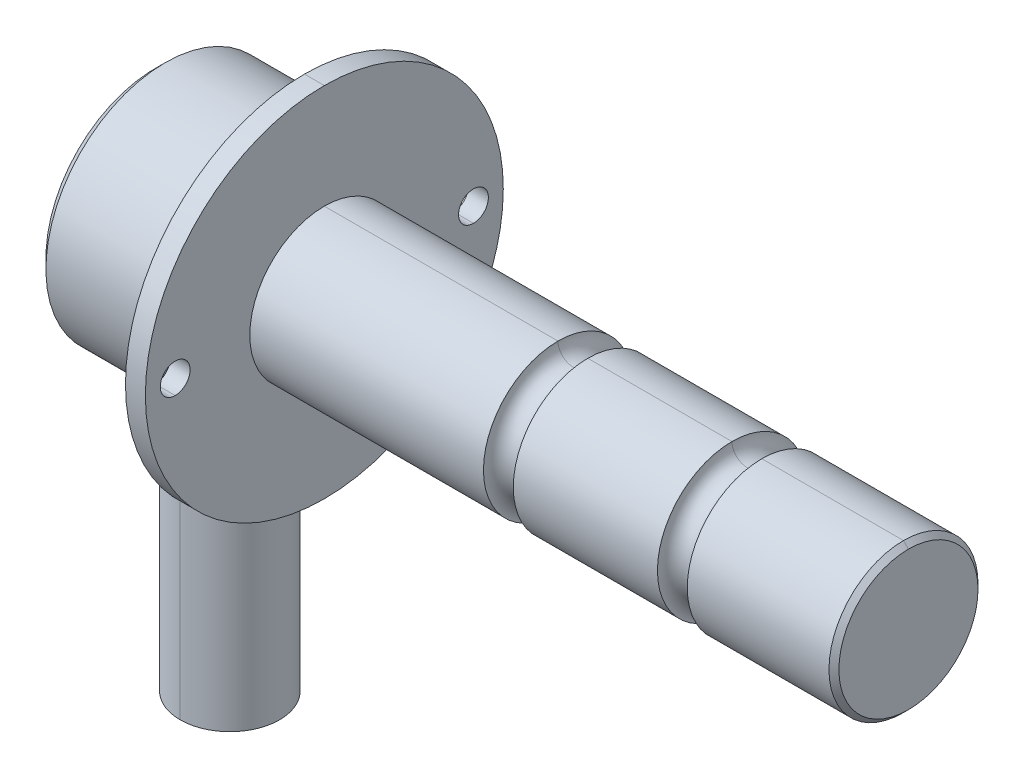
ISO-10303-21;
HEADER;
FILE_DESCRIPTION(('STEP AP214'),'2;1');
FILE_NAME('part.step','',(''),(''),'','','');
FILE_SCHEMA(('AUTOMOTIVE_DESIGN { 1 0 10303 214 1 1 1 1 }'));
ENDSEC;
DATA;
#1=APPLICATION_CONTEXT('core data for automotive mechanical design processes');
#2=APPLICATION_PROTOCOL_DEFINITION('international standard','automotive_design',2000,#1);
#3=PRODUCT_CONTEXT('',#1,'mechanical');
#4=PRODUCT('Part','Part','',(#3));
#5=PRODUCT_RELATED_PRODUCT_CATEGORY('part','',(#4));
#6=PRODUCT_DEFINITION_FORMATION('','',#4);
#7=PRODUCT_DEFINITION_CONTEXT('part definition',#1,'design');
#8=PRODUCT_DEFINITION('design','',#6,#7);
#9=PRODUCT_DEFINITION_SHAPE('','',#8);
#10=(LENGTH_UNIT() NAMED_UNIT(*) SI_UNIT(.MILLI.,.METRE.));
#11=(NAMED_UNIT(*) PLANE_ANGLE_UNIT() SI_UNIT($,.RADIAN.));
#12=(NAMED_UNIT(*) SI_UNIT($,.STERADIAN.) SOLID_ANGLE_UNIT());
#13=UNCERTAINTY_MEASURE_WITH_UNIT(LENGTH_MEASURE(1.E-05),#10,'distance_accuracy_value','');
#14=(GEOMETRIC_REPRESENTATION_CONTEXT(3) GLOBAL_UNCERTAINTY_ASSIGNED_CONTEXT((#13)) GLOBAL_UNIT_ASSIGNED_CONTEXT((#10,
#11,#12)) REPRESENTATION_CONTEXT('',''));
#15=CARTESIAN_POINT('',(0.,0.,0.));
#16=DIRECTION('',(0.,0.,1.));
#17=DIRECTION('',(1.,0.,0.));
#18=AXIS2_PLACEMENT_3D('',#15,#16,#17);
#19=CARTESIAN_POINT('',(0.,0.,0.));
#20=DIRECTION('',(1.,0.,0.));
#21=DIRECTION('',(0.,-1.,0.));
#22=AXIS2_PLACEMENT_3D('',#19,#20,#21);
#23=PLANE('',#22);
#24=CARTESIAN_POINT('',(0.,0.,30.));
#25=DIRECTION('',(1.,0.,0.));
#26=DIRECTION('',(0.,-1.,0.));
#27=AXIS2_PLACEMENT_3D('',#24,#25,#26);
#28=CIRCLE('',#27,3.);
#29=CARTESIAN_POINT('',(0.,-3.,30.));
#30=VERTEX_POINT('',#29);
#31=CARTESIAN_POINT('',(0.,3.,30.));
#32=VERTEX_POINT('',#31);
#33=EDGE_CURVE('E140',#30,#32,#28,.T.);
#34=ORIENTED_EDGE('',*,*,#33,.F.);
#35=CARTESIAN_POINT('',(0.,0.,30.));
#36=DIRECTION('',(1.,0.,0.));
#37=DIRECTION('',(0.,1.,0.));
#38=AXIS2_PLACEMENT_3D('',#35,#36,#37);
#39=CIRCLE('',#38,3.);
#40=EDGE_CURVE('E36',#32,#30,#39,.T.);
#41=ORIENTED_EDGE('',*,*,#40,.F.);
#42=EDGE_LOOP('',(#34,#41));
#43=FACE_BOUND('',#42,.T.);
#44=CARTESIAN_POINT('',(0.,0.,-30.));
#45=DIRECTION('',(1.,0.,0.));
#46=DIRECTION('',(0.,-1.,0.));
#47=AXIS2_PLACEMENT_3D('',#44,#45,#46);
#48=CIRCLE('',#47,3.);
#49=CARTESIAN_POINT('',(0.,-3.,-30.));
#50=VERTEX_POINT('',#49);
#51=CARTESIAN_POINT('',(0.,3.,-30.));
#52=VERTEX_POINT('',#51);
#53=EDGE_CURVE('E206',#50,#52,#48,.T.);
#54=ORIENTED_EDGE('',*,*,#53,.F.);
#55=CARTESIAN_POINT('',(0.,0.,-30.));
#56=DIRECTION('',(1.,0.,0.));
#57=DIRECTION('',(0.,1.,0.));
#58=AXIS2_PLACEMENT_3D('',#55,#56,#57);
#59=CIRCLE('',#58,3.);
#60=EDGE_CURVE('E155',#52,#50,#59,.T.);
#61=ORIENTED_EDGE('',*,*,#60,.F.);
#62=EDGE_LOOP('',(#54,#61));
#63=FACE_BOUND('',#62,.T.);
#64=CARTESIAN_POINT('',(0.,0.,0.));
#65=DIRECTION('',(1.,0.,0.));
#66=DIRECTION('',(0.,1.,0.));
#67=AXIS2_PLACEMENT_3D('',#64,#65,#66);
#68=CIRCLE('',#67,14.99);
#69=CARTESIAN_POINT('',(0.,14.99,0.));
#70=VERTEX_POINT('',#69);
#71=CARTESIAN_POINT('',(0.,-14.99,0.));
#72=VERTEX_POINT('',#71);
#73=EDGE_CURVE('E159',#70,#72,#68,.T.);
#74=ORIENTED_EDGE('',*,*,#73,.F.);
#75=CARTESIAN_POINT('',(0.,0.,0.));
#76=DIRECTION('',(-1.,0.,0.));
#77=DIRECTION('',(0.,1.,0.));
#78=AXIS2_PLACEMENT_3D('',#75,#76,#77);
#79=CIRCLE('',#78,14.99);
#80=EDGE_CURVE('E11',#70,#72,#79,.T.);
#81=ORIENTED_EDGE('',*,*,#80,.T.);
#82=EDGE_LOOP('',(#74,#81));
#83=FACE_BOUND('',#82,.T.);
#84=CARTESIAN_POINT('',(0.,0.,0.));
#85=DIRECTION('',(-1.,0.,0.));
#86=DIRECTION('',(0.,1.,0.));
#87=AXIS2_PLACEMENT_3D('',#84,#85,#86);
#88=CIRCLE('',#87,36.);
#89=CARTESIAN_POINT('',(0.,36.,0.));
#90=VERTEX_POINT('',#89);
#91=CARTESIAN_POINT('',(0.,-36.,0.));
#92=VERTEX_POINT('',#91);
#93=EDGE_CURVE('E193',#90,#92,#88,.T.);
#94=ORIENTED_EDGE('',*,*,#93,.F.);
#95=CARTESIAN_POINT('',(0.,0.,0.));
#96=DIRECTION('',(1.,0.,0.));
#97=DIRECTION('',(0.,1.,0.));
#98=AXIS2_PLACEMENT_3D('',#95,#96,#97);
#99=CIRCLE('',#98,36.);
#100=EDGE_CURVE('E27',#90,#92,#99,.T.);
#101=ORIENTED_EDGE('',*,*,#100,.T.);
#102=EDGE_LOOP('',(#94,#101));
#103=FACE_BOUND('',#102,.T.);
#104=ADVANCED_FACE('F16',(#43,#63,#83,#103),#23,.T.);
#105=CARTESIAN_POINT('',(-4.,0.,30.));
#106=DIRECTION('',(-1.,0.,0.));
#107=DIRECTION('',(0.,1.,0.));
#108=AXIS2_PLACEMENT_3D('',#105,#106,#107);
#109=CYLINDRICAL_SURFACE('',#108,3.);
#110=DIRECTION('',(1.,0.,0.));
#111=VECTOR('',#110,1.);
#112=CARTESIAN_POINT('',(-4.,3.,30.));
#113=LINE('',#112,#111);
#114=CARTESIAN_POINT('',(-4.,3.,30.));
#115=VERTEX_POINT('',#114);
#116=EDGE_CURVE('E130',#115,#32,#113,.T.);
#117=ORIENTED_EDGE('',*,*,#116,.F.);
#118=CARTESIAN_POINT('',(-4.,0.,30.));
#119=DIRECTION('',(1.,0.,0.));
#120=DIRECTION('',(0.,-1.,0.));
#121=AXIS2_PLACEMENT_3D('',#118,#119,#120);
#122=CIRCLE('',#121,3.);
#123=CARTESIAN_POINT('',(-4.,-3.,30.));
#124=VERTEX_POINT('',#123);
#125=EDGE_CURVE('E126',#124,#115,#122,.T.);
#126=ORIENTED_EDGE('',*,*,#125,.F.);
#127=DIRECTION('',(1.,0.,0.));
#128=VECTOR('',#127,1.);
#129=CARTESIAN_POINT('',(-4.,-3.,30.));
#130=LINE('',#129,#128);
#131=EDGE_CURVE('E129',#124,#30,#130,.T.);
#132=ORIENTED_EDGE('',*,*,#131,.T.);
#133=ORIENTED_EDGE('',*,*,#33,.T.);
#134=EDGE_LOOP('',(#117,#126,#132,#133));
#135=FACE_BOUND('',#134,.T.);
#136=ADVANCED_FACE('F127',(#135),#109,.F.);
#137=CARTESIAN_POINT('',(-4.,0.,30.));
#138=DIRECTION('',(-1.,0.,0.));
#139=DIRECTION('',(0.,1.,0.));
#140=AXIS2_PLACEMENT_3D('',#137,#138,#139);
#141=CYLINDRICAL_SURFACE('',#140,3.);
#142=ORIENTED_EDGE('',*,*,#131,.F.);
#143=CARTESIAN_POINT('',(-4.,0.,30.));
#144=DIRECTION('',(1.,0.,0.));
#145=DIRECTION('',(0.,1.,0.));
#146=AXIS2_PLACEMENT_3D('',#143,#144,#145);
#147=CIRCLE('',#146,3.);
#148=EDGE_CURVE('E136',#115,#124,#147,.T.);
#149=ORIENTED_EDGE('',*,*,#148,.F.);
#150=ORIENTED_EDGE('',*,*,#116,.T.);
#151=ORIENTED_EDGE('',*,*,#40,.T.);
#152=EDGE_LOOP('',(#142,#149,#150,#151));
#153=FACE_BOUND('',#152,.T.);
#154=ADVANCED_FACE('F138',(#153),#141,.F.);
#155=CARTESIAN_POINT('',(-4.,0.,-30.));
#156=DIRECTION('',(-1.,0.,0.));
#157=DIRECTION('',(0.,1.,0.));
#158=AXIS2_PLACEMENT_3D('',#155,#156,#157);
#159=CYLINDRICAL_SURFACE('',#158,3.);
#160=DIRECTION('',(1.,0.,0.));
#161=VECTOR('',#160,1.);
#162=CARTESIAN_POINT('',(-4.,3.,-30.));
#163=LINE('',#162,#161);
#164=CARTESIAN_POINT('',(-4.,3.,-30.));
#165=VERTEX_POINT('',#164);
#166=EDGE_CURVE('E158',#165,#52,#163,.T.);
#167=ORIENTED_EDGE('',*,*,#166,.F.);
#168=CARTESIAN_POINT('',(-4.,0.,-30.));
#169=DIRECTION('',(1.,0.,0.));
#170=DIRECTION('',(0.,-1.,0.));
#171=AXIS2_PLACEMENT_3D('',#168,#169,#170);
#172=CIRCLE('',#171,3.);
#173=CARTESIAN_POINT('',(-4.,-3.,-30.));
#174=VERTEX_POINT('',#173);
#175=EDGE_CURVE('E145',#174,#165,#172,.T.);
#176=ORIENTED_EDGE('',*,*,#175,.F.);
#177=DIRECTION('',(1.,0.,0.));
#178=VECTOR('',#177,1.);
#179=CARTESIAN_POINT('',(-4.,-3.,-30.));
#180=LINE('',#179,#178);
#181=EDGE_CURVE('E220',#174,#50,#180,.T.);
#182=ORIENTED_EDGE('',*,*,#181,.T.);
#183=ORIENTED_EDGE('',*,*,#53,.T.);
#184=EDGE_LOOP('',(#167,#176,#182,#183));
#185=FACE_BOUND('',#184,.T.);
#186=ADVANCED_FACE('F352',(#185),#159,.F.);
#187=CARTESIAN_POINT('',(-4.,0.,-30.));
#188=DIRECTION('',(-1.,0.,0.));
#189=DIRECTION('',(0.,1.,0.));
#190=AXIS2_PLACEMENT_3D('',#187,#188,#189);
#191=CYLINDRICAL_SURFACE('',#190,3.);
#192=ORIENTED_EDGE('',*,*,#181,.F.);
#193=CARTESIAN_POINT('',(-4.,0.,-30.));
#194=DIRECTION('',(1.,0.,0.));
#195=DIRECTION('',(0.,1.,0.));
#196=AXIS2_PLACEMENT_3D('',#193,#194,#195);
#197=CIRCLE('',#196,3.);
#198=EDGE_CURVE('E151',#165,#174,#197,.T.);
#199=ORIENTED_EDGE('',*,*,#198,.F.);
#200=ORIENTED_EDGE('',*,*,#166,.T.);
#201=ORIENTED_EDGE('',*,*,#60,.T.);
#202=EDGE_LOOP('',(#192,#199,#200,#201));
#203=FACE_BOUND('',#202,.T.);
#204=ADVANCED_FACE('F354',(#203),#191,.F.);
#205=CARTESIAN_POINT('',(-41.575,0.,0.));
#206=DIRECTION('',(-1.,0.,0.));
#207=DIRECTION('',(0.,-1.,0.));
#208=AXIS2_PLACEMENT_3D('',#205,#206,#207);
#209=CYLINDRICAL_SURFACE('',#208,14.99);
#210=ORIENTED_EDGE('',*,*,#73,.T.);
#211=DIRECTION('',(-1.,0.,0.));
#212=VECTOR('',#211,1.);
#213=CARTESIAN_POINT('',(47.,-14.99,0.));
#214=LINE('',#213,#212);
#215=CARTESIAN_POINT('',(47.,-14.99,0.));
#216=VERTEX_POINT('',#215);
#217=EDGE_CURVE('E196',#216,#72,#214,.T.);
#218=ORIENTED_EDGE('',*,*,#217,.F.);
#219=CARTESIAN_POINT('',(47.,0.,0.));
#220=DIRECTION('',(1.,0.,0.));
#221=DIRECTION('',(0.,1.,0.));
#222=AXIS2_PLACEMENT_3D('',#219,#220,#221);
#223=CIRCLE('',#222,14.99);
#224=CARTESIAN_POINT('',(47.,14.99,0.));
#225=VERTEX_POINT('',#224);
#226=EDGE_CURVE('E164',#225,#216,#223,.T.);
#227=ORIENTED_EDGE('',*,*,#226,.F.);
#228=DIRECTION('',(-1.,0.,0.));
#229=VECTOR('',#228,1.);
#230=CARTESIAN_POINT('',(47.,14.99,0.));
#231=LINE('',#230,#229);
#232=EDGE_CURVE('E261',#225,#70,#231,.T.);
#233=ORIENTED_EDGE('',*,*,#232,.T.);
#234=EDGE_LOOP('',(#210,#218,#227,#233));
#235=FACE_BOUND('',#234,.T.);
#236=ADVANCED_FACE('F459',(#235),#209,.T.);
#237=CARTESIAN_POINT('',(-41.575,0.,0.));
#238=DIRECTION('',(-1.,0.,0.));
#239=DIRECTION('',(0.,-1.,0.));
#240=AXIS2_PLACEMENT_3D('',#237,#238,#239);
#241=CYLINDRICAL_SURFACE('',#240,14.99);
#242=CARTESIAN_POINT('',(47.,0.,0.));
#243=DIRECTION('',(-1.,0.,0.));
#244=DIRECTION('',(0.,1.,0.));
#245=AXIS2_PLACEMENT_3D('',#242,#243,#244);
#246=CIRCLE('',#245,14.99);
#247=EDGE_CURVE('E265',#225,#216,#246,.T.);
#248=ORIENTED_EDGE('',*,*,#247,.T.);
#249=ORIENTED_EDGE('',*,*,#217,.T.);
#250=ORIENTED_EDGE('',*,*,#80,.F.);
#251=ORIENTED_EDGE('',*,*,#232,.F.);
#252=EDGE_LOOP('',(#248,#249,#250,#251));
#253=FACE_BOUND('',#252,.T.);
#254=ADVANCED_FACE('F455',(#253),#241,.T.);
#255=CARTESIAN_POINT('',(-41.575,0.,0.));
#256=DIRECTION('',(-1.,0.,0.));
#257=DIRECTION('',(0.,-1.,0.));
#258=AXIS2_PLACEMENT_3D('',#255,#256,#257);
#259=CYLINDRICAL_SURFACE('',#258,36.);
#260=ORIENTED_EDGE('',*,*,#93,.T.);
#261=DIRECTION('',(-1.,0.,0.));
#262=VECTOR('',#261,1.);
#263=CARTESIAN_POINT('',(0.,-36.,0.));
#264=LINE('',#263,#262);
#265=CARTESIAN_POINT('',(-4.,-36.,0.));
#266=VERTEX_POINT('',#265);
#267=EDGE_CURVE('E197',#92,#266,#264,.T.);
#268=ORIENTED_EDGE('',*,*,#267,.T.);
#269=CARTESIAN_POINT('',(-4.,0.,0.));
#270=DIRECTION('',(-1.,0.,0.));
#271=DIRECTION('',(0.,1.,0.));
#272=AXIS2_PLACEMENT_3D('',#269,#270,#271);
#273=CIRCLE('',#272,36.);
#274=CARTESIAN_POINT('',(-4.,36.,0.));
#275=VERTEX_POINT('',#274);
#276=EDGE_CURVE('E160',#275,#266,#273,.T.);
#277=ORIENTED_EDGE('',*,*,#276,.F.);
#278=DIRECTION('',(-1.,0.,0.));
#279=VECTOR('',#278,1.);
#280=CARTESIAN_POINT('',(0.,36.,0.));
#281=LINE('',#280,#279);
#282=EDGE_CURVE('E252',#90,#275,#281,.T.);
#283=ORIENTED_EDGE('',*,*,#282,.F.);
#284=EDGE_LOOP('',(#260,#268,#277,#283));
#285=FACE_BOUND('',#284,.T.);
#286=ADVANCED_FACE('F474',(#285),#259,.T.);
#287=CARTESIAN_POINT('',(-41.575,0.,0.));
#288=DIRECTION('',(-1.,0.,0.));
#289=DIRECTION('',(0.,-1.,0.));
#290=AXIS2_PLACEMENT_3D('',#287,#288,#289);
#291=CYLINDRICAL_SURFACE('',#290,36.);
#292=CARTESIAN_POINT('',(-4.,0.,0.));
#293=DIRECTION('',(1.,0.,0.));
#294=DIRECTION('',(0.,1.,0.));
#295=AXIS2_PLACEMENT_3D('',#292,#293,#294);
#296=CIRCLE('',#295,36.);
#297=EDGE_CURVE('E256',#275,#266,#296,.T.);
#298=ORIENTED_EDGE('',*,*,#297,.T.);
#299=ORIENTED_EDGE('',*,*,#267,.F.);
#300=ORIENTED_EDGE('',*,*,#100,.F.);
#301=ORIENTED_EDGE('',*,*,#282,.T.);
#302=EDGE_LOOP('',(#298,#299,#300,#301));
#303=FACE_BOUND('',#302,.T.);
#304=ADVANCED_FACE('F472',(#303),#291,.T.);
#305=CARTESIAN_POINT('',(-4.,0.,0.));
#306=DIRECTION('',(1.,0.,0.));
#307=DIRECTION('',(0.,-1.,0.));
#308=AXIS2_PLACEMENT_3D('',#305,#306,#307);
#309=PLANE('',#308);
#310=DIRECTION('',(0.,0.,-1.));
#311=VECTOR('',#310,1.);
#312=CARTESIAN_POINT('',(-4.,-21.,11.6189500386222));
#313=LINE('',#312,#311);
#314=CARTESIAN_POINT('',(-4.,-21.,11.6189500386222));
#315=VERTEX_POINT('',#314);
#316=CARTESIAN_POINT('',(-4.,-21.,-11.6189500386222));
#317=VERTEX_POINT('',#316);
#318=EDGE_CURVE('E171',#315,#317,#313,.T.);
#319=ORIENTED_EDGE('',*,*,#318,.T.);
#320=CARTESIAN_POINT('',(-4.,0.,0.));
#321=DIRECTION('',(1.,0.,0.));
#322=DIRECTION('',(0.,-0.875,-0.484122918275926));
#323=AXIS2_PLACEMENT_3D('',#320,#321,#322);
#324=CIRCLE('',#323,24.);
#325=EDGE_CURVE('E135',#317,#315,#324,.T.);
#326=ORIENTED_EDGE('',*,*,#325,.T.);
#327=EDGE_LOOP('',(#319,#326));
#328=FACE_BOUND('',#327,.T.);
#329=ORIENTED_EDGE('',*,*,#125,.T.);
#330=ORIENTED_EDGE('',*,*,#148,.T.);
#331=EDGE_LOOP('',(#329,#330));
#332=FACE_BOUND('',#331,.T.);
#333=ORIENTED_EDGE('',*,*,#175,.T.);
#334=ORIENTED_EDGE('',*,*,#198,.T.);
#335=EDGE_LOOP('',(#333,#334));
#336=FACE_BOUND('',#335,.T.);
#337=ORIENTED_EDGE('',*,*,#297,.F.);
#338=ORIENTED_EDGE('',*,*,#276,.T.);
#339=EDGE_LOOP('',(#337,#338));
#340=FACE_BOUND('',#339,.T.);
#341=ADVANCED_FACE('F142',(#328,#332,#336,#340),#309,.F.);
#342=CARTESIAN_POINT('',(50.,0.,0.));
#343=DIRECTION('',(1.,0.,0.));
#344=DIRECTION('',(0.,-1.,0.));
#345=AXIS2_PLACEMENT_3D('',#342,#343,#344);
#346=TOROIDAL_SURFACE('',#345,14.99,3.);
#347=ORIENTED_EDGE('',*,*,#226,.T.);
#348=CARTESIAN_POINT('',(50.,-14.99,0.));
#349=DIRECTION('',(0.,0.,1.));
#350=DIRECTION('',(1.,0.,0.));
#351=AXIS2_PLACEMENT_3D('',#348,#349,#350);
#352=CIRCLE('',#351,3.);
#353=CARTESIAN_POINT('',(53.,-14.99,0.));
#354=VERTEX_POINT('',#353);
#355=EDGE_CURVE('E183',#354,#216,#352,.T.);
#356=ORIENTED_EDGE('',*,*,#355,.F.);
#357=CARTESIAN_POINT('',(53.,0.,0.));
#358=DIRECTION('',(1.,0.,0.));
#359=DIRECTION('',(0.,1.,0.));
#360=AXIS2_PLACEMENT_3D('',#357,#358,#359);
#361=CIRCLE('',#360,14.99);
#362=CARTESIAN_POINT('',(53.,14.99,0.));
#363=VERTEX_POINT('',#362);
#364=EDGE_CURVE('E239',#363,#354,#361,.T.);
#365=ORIENTED_EDGE('',*,*,#364,.F.);
#366=CARTESIAN_POINT('',(50.,14.99,0.));
#367=DIRECTION('',(0.,0.,-1.));
#368=DIRECTION('',(1.,0.,0.));
#369=AXIS2_PLACEMENT_3D('',#366,#367,#368);
#370=CIRCLE('',#369,3.);
#371=EDGE_CURVE('E182',#363,#225,#370,.T.);
#372=ORIENTED_EDGE('',*,*,#371,.T.);
#373=EDGE_LOOP('',(#347,#356,#365,#372));
#374=FACE_BOUND('',#373,.T.);
#375=ADVANCED_FACE('F698',(#374),#346,.F.);
#376=CARTESIAN_POINT('',(50.,0.,0.));
#377=DIRECTION('',(1.,0.,0.));
#378=DIRECTION('',(0.,-1.,0.));
#379=AXIS2_PLACEMENT_3D('',#376,#377,#378);
#380=TOROIDAL_SURFACE('',#379,14.99,3.);
#381=CARTESIAN_POINT('',(53.,0.,0.));
#382=DIRECTION('',(-1.,0.,0.));
#383=DIRECTION('',(0.,1.,0.));
#384=AXIS2_PLACEMENT_3D('',#381,#382,#383);
#385=CIRCLE('',#384,14.99);
#386=EDGE_CURVE('E178',#363,#354,#385,.T.);
#387=ORIENTED_EDGE('',*,*,#386,.T.);
#388=ORIENTED_EDGE('',*,*,#355,.T.);
#389=ORIENTED_EDGE('',*,*,#247,.F.);
#390=ORIENTED_EDGE('',*,*,#371,.F.);
#391=EDGE_LOOP('',(#387,#388,#389,#390));
#392=FACE_BOUND('',#391,.T.);
#393=ADVANCED_FACE('F18',(#392),#380,.F.);
#394=CARTESIAN_POINT('',(-4.,-21.,11.6189500386222));
#395=DIRECTION('',(0.,1.,0.));
#396=DIRECTION('',(0.,0.,-1.));
#397=AXIS2_PLACEMENT_3D('',#394,#395,#396);
#398=PLANE('',#397);
#399=CARTESIAN_POINT('',(-19.,-21.,0.));
#400=DIRECTION('',(0.,-1.,0.));
#401=DIRECTION('',(0.,0.,-1.));
#402=AXIS2_PLACEMENT_3D('',#399,#400,#401);
#403=CIRCLE('',#402,10.);
#404=CARTESIAN_POINT('',(-19.,-21.,-10.));
#405=VERTEX_POINT('',#404);
#406=CARTESIAN_POINT('',(-19.,-21.,10.));
#407=VERTEX_POINT('',#406);
#408=EDGE_CURVE('E176',#405,#407,#403,.T.);
#409=ORIENTED_EDGE('',*,*,#408,.F.);
#410=CARTESIAN_POINT('',(-19.,-21.,0.));
#411=DIRECTION('',(0.,-1.,0.));
#412=DIRECTION('',(0.,0.,1.));
#413=AXIS2_PLACEMENT_3D('',#410,#411,#412);
#414=CIRCLE('',#413,10.);
#415=EDGE_CURVE('E177',#407,#405,#414,.T.);
#416=ORIENTED_EDGE('',*,*,#415,.F.);
#417=EDGE_LOOP('',(#409,#416));
#418=FACE_BOUND('',#417,.T.);
#419=CARTESIAN_POINT('',(-32.,-21.,11.6189500386222));
#420=CARTESIAN_POINT('',(-33.2460390672402,-21.,9.06268249515085));
#421=CARTESIAN_POINT('',(-34.,-21.,6.55743852430196));
#422=B_SPLINE_CURVE_WITH_KNOTS('',2,(#419,#420,#421),.UNSPECIFIED.,.F.,.F.,(3,3),(0.,1.),.UNSPECIFIED.);
#423=CARTESIAN_POINT('',(-32.,-21.,11.6189500386222));
#424=VERTEX_POINT('',#423);
#425=CARTESIAN_POINT('',(-34.,-21.,6.55743852430197));
#426=VERTEX_POINT('',#425);
#427=EDGE_CURVE('E187',#424,#426,#422,.T.);
#428=ORIENTED_EDGE('',*,*,#427,.T.);
#429=DIRECTION('',(0.,0.,-1.));
#430=VECTOR('',#429,1.);
#431=CARTESIAN_POINT('',(-34.,-21.,6.55743852430196));
#432=LINE('',#431,#430);
#433=CARTESIAN_POINT('',(-34.,-21.,-6.55743852430198));
#434=VERTEX_POINT('',#433);
#435=EDGE_CURVE('E376',#426,#434,#432,.T.);
#436=ORIENTED_EDGE('',*,*,#435,.T.);
#437=CARTESIAN_POINT('',(-34.,-21.,-6.55743852430198));
#438=CARTESIAN_POINT('',(-33.2460128034555,-21.,-9.06265773828433));
#439=CARTESIAN_POINT('',(-32.,-21.,-11.6189500386223));
#440=B_SPLINE_CURVE_WITH_KNOTS('',2,(#437,#438,#439),.UNSPECIFIED.,.F.,.F.,(3,3),(0.,1.),.UNSPECIFIED.);
#441=CARTESIAN_POINT('',(-32.,-21.,-11.6189500386222));
#442=VERTEX_POINT('',#441);
#443=EDGE_CURVE('E335',#434,#442,#440,.T.);
#444=ORIENTED_EDGE('',*,*,#443,.T.);
#445=DIRECTION('',(1.,0.,0.));
#446=VECTOR('',#445,1.);
#447=CARTESIAN_POINT('',(-32.,-21.,-11.6189500386222));
#448=LINE('',#447,#446);
#449=EDGE_CURVE('E339',#442,#317,#448,.T.);
#450=ORIENTED_EDGE('',*,*,#449,.T.);
#451=ORIENTED_EDGE('',*,*,#318,.F.);
#452=DIRECTION('',(1.,0.,0.));
#453=VECTOR('',#452,1.);
#454=CARTESIAN_POINT('',(-32.,-21.,11.6189500386222));
#455=LINE('',#454,#453);
#456=EDGE_CURVE('E360',#424,#315,#455,.T.);
#457=ORIENTED_EDGE('',*,*,#456,.F.);
#458=EDGE_LOOP('',(#428,#436,#444,#450,#451,#457));
#459=FACE_BOUND('',#458,.T.);
#460=ADVANCED_FACE('F303',(#418,#459),#398,.F.);
#461=CARTESIAN_POINT('',(-41.575,0.,0.));
#462=DIRECTION('',(-1.,0.,0.));
#463=DIRECTION('',(0.,-1.,0.));
#464=AXIS2_PLACEMENT_3D('',#461,#462,#463);
#465=CYLINDRICAL_SURFACE('',#464,24.);
#466=ORIENTED_EDGE('',*,*,#456,.T.);
#467=ORIENTED_EDGE('',*,*,#325,.F.);
#468=ORIENTED_EDGE('',*,*,#449,.F.);
#469=CARTESIAN_POINT('',(-32.,0.,0.));
#470=DIRECTION('',(1.,0.,0.));
#471=DIRECTION('',(0.,-0.875,-0.484122918275927));
#472=AXIS2_PLACEMENT_3D('',#469,#470,#471);
#473=CIRCLE('',#472,24.);
#474=EDGE_CURVE('E243',#442,#424,#473,.T.);
#475=ORIENTED_EDGE('',*,*,#474,.T.);
#476=EDGE_LOOP('',(#466,#467,#468,#475));
#477=FACE_BOUND('',#476,.T.);
#478=ADVANCED_FACE('F313',(#477),#465,.T.);
#479=CARTESIAN_POINT('',(-41.575,0.,0.));
#480=DIRECTION('',(-1.,0.,0.));
#481=DIRECTION('',(0.,-1.,0.));
#482=AXIS2_PLACEMENT_3D('',#479,#480,#481);
#483=CYLINDRICAL_SURFACE('',#482,14.99);
#484=ORIENTED_EDGE('',*,*,#364,.T.);
#485=DIRECTION('',(-1.,0.,0.));
#486=VECTOR('',#485,1.);
#487=CARTESIAN_POINT('',(82.,-14.99,0.));
#488=LINE('',#487,#486);
#489=CARTESIAN_POINT('',(82.,-14.99,0.));
#490=VERTEX_POINT('',#489);
#491=EDGE_CURVE('E192',#490,#354,#488,.T.);
#492=ORIENTED_EDGE('',*,*,#491,.F.);
#493=CARTESIAN_POINT('',(82.,0.,0.));
#494=DIRECTION('',(1.,0.,0.));
#495=DIRECTION('',(0.,1.,0.));
#496=AXIS2_PLACEMENT_3D('',#493,#494,#495);
#497=CIRCLE('',#496,14.99);
#498=CARTESIAN_POINT('',(82.,14.99,0.));
#499=VERTEX_POINT('',#498);
#500=EDGE_CURVE('E259',#499,#490,#497,.T.);
#501=ORIENTED_EDGE('',*,*,#500,.F.);
#502=DIRECTION('',(-1.,0.,0.));
#503=VECTOR('',#502,1.);
#504=CARTESIAN_POINT('',(82.,14.99,0.));
#505=LINE('',#504,#503);
#506=EDGE_CURVE('E244',#499,#363,#505,.T.);
#507=ORIENTED_EDGE('',*,*,#506,.T.);
#508=EDGE_LOOP('',(#484,#492,#501,#507));
#509=FACE_BOUND('',#508,.T.);
#510=ADVANCED_FACE('F315',(#509),#483,.T.);
#511=CARTESIAN_POINT('',(-41.575,0.,0.));
#512=DIRECTION('',(-1.,0.,0.));
#513=DIRECTION('',(0.,-1.,0.));
#514=AXIS2_PLACEMENT_3D('',#511,#512,#513);
#515=CYLINDRICAL_SURFACE('',#514,14.99);
#516=CARTESIAN_POINT('',(82.,0.,0.));
#517=DIRECTION('',(-1.,0.,0.));
#518=DIRECTION('',(0.,1.,0.));
#519=AXIS2_PLACEMENT_3D('',#516,#517,#518);
#520=CIRCLE('',#519,14.99);
#521=EDGE_CURVE('E266',#499,#490,#520,.T.);
#522=ORIENTED_EDGE('',*,*,#521,.T.);
#523=ORIENTED_EDGE('',*,*,#491,.T.);
#524=ORIENTED_EDGE('',*,*,#386,.F.);
#525=ORIENTED_EDGE('',*,*,#506,.F.);
#526=EDGE_LOOP('',(#522,#523,#524,#525));
#527=FACE_BOUND('',#526,.T.);
#528=ADVANCED_FACE('F497',(#527),#515,.T.);
#529=CARTESIAN_POINT('',(-19.,-21.,0.));
#530=DIRECTION('',(0.,1.,0.));
#531=DIRECTION('',(0.,0.,1.));
#532=AXIS2_PLACEMENT_3D('',#529,#530,#531);
#533=CYLINDRICAL_SURFACE('',#532,10.);
#534=DIRECTION('',(0.,-1.,0.));
#535=VECTOR('',#534,1.);
#536=CARTESIAN_POINT('',(-19.,-21.,10.));
#537=LINE('',#536,#535);
#538=CARTESIAN_POINT('',(-19.,-79.,10.));
#539=VERTEX_POINT('',#538);
#540=EDGE_CURVE('E188',#407,#539,#537,.T.);
#541=ORIENTED_EDGE('',*,*,#540,.T.);
#542=CARTESIAN_POINT('',(-19.,-79.,0.));
#543=DIRECTION('',(0.,-1.,0.));
#544=DIRECTION('',(0.,0.,-1.));
#545=AXIS2_PLACEMENT_3D('',#542,#543,#544);
#546=CIRCLE('',#545,10.);
#547=CARTESIAN_POINT('',(-19.,-79.,-10.));
#548=VERTEX_POINT('',#547);
#549=EDGE_CURVE('E283',#548,#539,#546,.T.);
#550=ORIENTED_EDGE('',*,*,#549,.F.);
#551=DIRECTION('',(0.,-1.,0.));
#552=VECTOR('',#551,1.);
#553=CARTESIAN_POINT('',(-19.,-21.,-10.));
#554=LINE('',#553,#552);
#555=EDGE_CURVE('E172',#405,#548,#554,.T.);
#556=ORIENTED_EDGE('',*,*,#555,.F.);
#557=ORIENTED_EDGE('',*,*,#408,.T.);
#558=EDGE_LOOP('',(#541,#550,#556,#557));
#559=FACE_BOUND('',#558,.T.);
#560=ADVANCED_FACE('F317',(#559),#533,.T.);
#561=CARTESIAN_POINT('',(-19.,-21.,0.));
#562=DIRECTION('',(0.,1.,0.));
#563=DIRECTION('',(0.,0.,1.));
#564=AXIS2_PLACEMENT_3D('',#561,#562,#563);
#565=CYLINDRICAL_SURFACE('',#564,10.);
#566=ORIENTED_EDGE('',*,*,#555,.T.);
#567=CARTESIAN_POINT('',(-19.,-79.,0.));
#568=DIRECTION('',(0.,-1.,0.));
#569=DIRECTION('',(0.,0.,1.));
#570=AXIS2_PLACEMENT_3D('',#567,#568,#569);
#571=CIRCLE('',#570,10.);
#572=EDGE_CURVE('E277',#539,#548,#571,.T.);
#573=ORIENTED_EDGE('',*,*,#572,.F.);
#574=ORIENTED_EDGE('',*,*,#540,.F.);
#575=ORIENTED_EDGE('',*,*,#415,.T.);
#576=EDGE_LOOP('',(#566,#573,#574,#575));
#577=FACE_BOUND('',#576,.T.);
#578=ADVANCED_FACE('F351',(#577),#565,.T.);
#579=CARTESIAN_POINT('',(-55.,0.,0.));
#580=DIRECTION('',(1.,0.,0.));
#581=DIRECTION('',(0.,0.,-1.));
#582=AXIS2_PLACEMENT_3D('',#579,#580,#581);
#583=CONICAL_SURFACE('',#582,1.,0.785398163397448);
#584=ORIENTED_EDGE('',*,*,#443,.F.);
#585=CARTESIAN_POINT('',(-34.,0.,0.));
#586=DIRECTION('',(-1.,0.,0.));
#587=DIRECTION('',(0.,-0.954545454545455,0.298065387468271));
#588=AXIS2_PLACEMENT_3D('',#585,#586,#587);
#589=CIRCLE('',#588,22.);
#590=EDGE_CURVE('E381',#426,#434,#589,.T.);
#591=ORIENTED_EDGE('',*,*,#590,.F.);
#592=ORIENTED_EDGE('',*,*,#427,.F.);
#593=ORIENTED_EDGE('',*,*,#474,.F.);
#594=EDGE_LOOP('',(#584,#591,#592,#593));
#595=FACE_BOUND('',#594,.T.);
#596=ADVANCED_FACE('F340',(#595),#583,.T.);
#597=CARTESIAN_POINT('',(-34.,0.,0.));
#598=DIRECTION('',(1.,0.,0.));
#599=DIRECTION('',(0.,-1.,0.));
#600=AXIS2_PLACEMENT_3D('',#597,#598,#599);
#601=PLANE('',#600);
#602=ORIENTED_EDGE('',*,*,#590,.T.);
#603=ORIENTED_EDGE('',*,*,#435,.F.);
#604=EDGE_LOOP('',(#602,#603));
#605=FACE_BOUND('',#604,.T.);
#606=ADVANCED_FACE('F350',(#605),#601,.F.);
#607=CARTESIAN_POINT('',(85.,0.,0.));
#608=DIRECTION('',(1.,0.,0.));
#609=DIRECTION('',(0.,-1.,0.));
#610=AXIS2_PLACEMENT_3D('',#607,#608,#609);
#611=TOROIDAL_SURFACE('',#610,14.99,3.);
#612=ORIENTED_EDGE('',*,*,#500,.T.);
#613=CARTESIAN_POINT('',(85.,-14.99,0.));
#614=DIRECTION('',(0.,0.,1.));
#615=DIRECTION('',(1.,0.,0.));
#616=AXIS2_PLACEMENT_3D('',#613,#614,#615);
#617=CIRCLE('',#616,3.);
#618=CARTESIAN_POINT('',(88.,-14.99,0.));
#619=VERTEX_POINT('',#618);
#620=EDGE_CURVE('E233',#619,#490,#617,.T.);
#621=ORIENTED_EDGE('',*,*,#620,.F.);
#622=CARTESIAN_POINT('',(88.,0.,0.));
#623=DIRECTION('',(1.,0.,0.));
#624=DIRECTION('',(0.,1.,0.));
#625=AXIS2_PLACEMENT_3D('',#622,#623,#624);
#626=CIRCLE('',#625,14.99);
#627=CARTESIAN_POINT('',(88.,14.99,0.));
#628=VERTEX_POINT('',#627);
#629=EDGE_CURVE('E212',#628,#619,#626,.T.);
#630=ORIENTED_EDGE('',*,*,#629,.F.);
#631=CARTESIAN_POINT('',(85.,14.99,0.));
#632=DIRECTION('',(0.,0.,-1.));
#633=DIRECTION('',(1.,0.,0.));
#634=AXIS2_PLACEMENT_3D('',#631,#632,#633);
#635=CIRCLE('',#634,3.);
#636=EDGE_CURVE('E232',#628,#499,#635,.T.);
#637=ORIENTED_EDGE('',*,*,#636,.T.);
#638=EDGE_LOOP('',(#612,#621,#630,#637));
#639=FACE_BOUND('',#638,.T.);
#640=ADVANCED_FACE('F499',(#639),#611,.F.);
#641=CARTESIAN_POINT('',(85.,0.,0.));
#642=DIRECTION('',(1.,0.,0.));
#643=DIRECTION('',(0.,-1.,0.));
#644=AXIS2_PLACEMENT_3D('',#641,#642,#643);
#645=TOROIDAL_SURFACE('',#644,14.99,3.);
#646=CARTESIAN_POINT('',(88.,0.,0.));
#647=DIRECTION('',(-1.,0.,0.));
#648=DIRECTION('',(0.,1.,0.));
#649=AXIS2_PLACEMENT_3D('',#646,#647,#648);
#650=CIRCLE('',#649,14.99);
#651=EDGE_CURVE('E229',#628,#619,#650,.T.);
#652=ORIENTED_EDGE('',*,*,#651,.T.);
#653=ORIENTED_EDGE('',*,*,#620,.T.);
#654=ORIENTED_EDGE('',*,*,#521,.F.);
#655=ORIENTED_EDGE('',*,*,#636,.F.);
#656=EDGE_LOOP('',(#652,#653,#654,#655));
#657=FACE_BOUND('',#656,.T.);
#658=ADVANCED_FACE('F494',(#657),#645,.F.);
#659=CARTESIAN_POINT('',(-4.,-79.,0.));
#660=DIRECTION('',(0.,-1.,0.));
#661=DIRECTION('',(0.,0.,1.));
#662=AXIS2_PLACEMENT_3D('',#659,#660,#661);
#663=PLANE('',#662);
#664=CARTESIAN_POINT('',(-19.,-79.,0.));
#665=DIRECTION('',(0.,1.,0.));
#666=DIRECTION('',(0.,0.,-1.));
#667=AXIS2_PLACEMENT_3D('',#664,#665,#666);
#668=CIRCLE('',#667,6.);
#669=CARTESIAN_POINT('',(-19.,-79.,-6.));
#670=VERTEX_POINT('',#669);
#671=CARTESIAN_POINT('',(-19.,-79.,6.));
#672=VERTEX_POINT('',#671);
#673=EDGE_CURVE('E238',#670,#672,#668,.T.);
#674=ORIENTED_EDGE('',*,*,#673,.T.);
#675=CARTESIAN_POINT('',(-19.,-79.,0.));
#676=DIRECTION('',(0.,1.,0.));
#677=DIRECTION('',(0.,0.,1.));
#678=AXIS2_PLACEMENT_3D('',#675,#676,#677);
#679=CIRCLE('',#678,6.);
#680=EDGE_CURVE('E417',#672,#670,#679,.T.);
#681=ORIENTED_EDGE('',*,*,#680,.T.);
#682=EDGE_LOOP('',(#674,#681));
#683=FACE_BOUND('',#682,.T.);
#684=ORIENTED_EDGE('',*,*,#549,.T.);
#685=ORIENTED_EDGE('',*,*,#572,.T.);
#686=EDGE_LOOP('',(#684,#685));
#687=FACE_BOUND('',#686,.T.);
#688=ADVANCED_FACE('F654',(#683,#687),#663,.T.);
#689=CARTESIAN_POINT('',(-41.575,0.,0.));
#690=DIRECTION('',(-1.,0.,0.));
#691=DIRECTION('',(0.,-1.,0.));
#692=AXIS2_PLACEMENT_3D('',#689,#690,#691);
#693=CYLINDRICAL_SURFACE('',#692,14.99);
#694=DIRECTION('',(-1.,0.,0.));
#695=VECTOR('',#694,1.);
#696=CARTESIAN_POINT('',(116.5,14.99,0.));
#697=LINE('',#696,#695);
#698=CARTESIAN_POINT('',(116.500000000792,14.9899999992079,6.88173507227624E-08));
#699=VERTEX_POINT('',#698);
#700=EDGE_CURVE('E273',#699,#628,#697,.T.);
#701=ORIENTED_EDGE('',*,*,#700,.T.);
#702=ORIENTED_EDGE('',*,*,#629,.T.);
#703=DIRECTION('',(-1.,0.,0.));
#704=VECTOR('',#703,1.);
#705=CARTESIAN_POINT('',(116.5,-14.99,0.));
#706=LINE('',#705,#704);
#707=CARTESIAN_POINT('',(116.500000000792,-14.9899999992079,-6.88173516406352E-08));
#708=VERTEX_POINT('',#707);
#709=EDGE_CURVE('E202',#708,#619,#706,.T.);
#710=ORIENTED_EDGE('',*,*,#709,.F.);
#711=CARTESIAN_POINT('',(116.5,0.,0.));
#712=DIRECTION('',(-1.,0.,0.));
#713=DIRECTION('',(0.,-1.,0.));
#714=AXIS2_PLACEMENT_3D('',#711,#712,#713);
#715=CIRCLE('',#714,14.99);
#716=EDGE_CURVE('E208',#708,#699,#715,.T.);
#717=ORIENTED_EDGE('',*,*,#716,.T.);
#718=EDGE_LOOP('',(#701,#702,#710,#717));
#719=FACE_BOUND('',#718,.T.);
#720=ADVANCED_FACE('F508',(#719),#693,.T.);
#721=CARTESIAN_POINT('',(-41.575,0.,0.));
#722=DIRECTION('',(-1.,0.,0.));
#723=DIRECTION('',(0.,-1.,0.));
#724=AXIS2_PLACEMENT_3D('',#721,#722,#723);
#725=CYLINDRICAL_SURFACE('',#724,14.99);
#726=ORIENTED_EDGE('',*,*,#709,.T.);
#727=ORIENTED_EDGE('',*,*,#651,.F.);
#728=ORIENTED_EDGE('',*,*,#700,.F.);
#729=CARTESIAN_POINT('',(116.5,0.,0.));
#730=DIRECTION('',(-1.,0.,0.));
#731=DIRECTION('',(0.,1.,0.));
#732=AXIS2_PLACEMENT_3D('',#729,#730,#731);
#733=CIRCLE('',#732,14.99);
#734=EDGE_CURVE('E198',#699,#708,#733,.T.);
#735=ORIENTED_EDGE('',*,*,#734,.T.);
#736=EDGE_LOOP('',(#726,#727,#728,#735));
#737=FACE_BOUND('',#736,.T.);
#738=ADVANCED_FACE('F505',(#737),#725,.T.);
#739=CARTESIAN_POINT('',(-19.,-21.,0.));
#740=DIRECTION('',(0.,1.,0.));
#741=DIRECTION('',(0.,0.,1.));
#742=AXIS2_PLACEMENT_3D('',#739,#740,#741);
#743=CYLINDRICAL_SURFACE('',#742,6.);
#744=DIRECTION('',(0.,-1.,0.));
#745=VECTOR('',#744,1.);
#746=CARTESIAN_POINT('',(-19.,-21.,6.));
#747=LINE('',#746,#745);
#748=CARTESIAN_POINT('',(-19.,-21.,6.));
#749=VERTEX_POINT('',#748);
#750=EDGE_CURVE('E203',#749,#672,#747,.T.);
#751=ORIENTED_EDGE('',*,*,#750,.T.);
#752=ORIENTED_EDGE('',*,*,#673,.F.);
#753=DIRECTION('',(0.,-1.,0.));
#754=VECTOR('',#753,1.);
#755=CARTESIAN_POINT('',(-19.,-21.,-6.));
#756=LINE('',#755,#754);
#757=CARTESIAN_POINT('',(-19.,-21.,-6.));
#758=VERTEX_POINT('',#757);
#759=EDGE_CURVE('E215',#758,#670,#756,.T.);
#760=ORIENTED_EDGE('',*,*,#759,.F.);
#761=CARTESIAN_POINT('',(-19.,-21.,0.));
#762=DIRECTION('',(0.,-1.,0.));
#763=DIRECTION('',(0.,0.,1.));
#764=AXIS2_PLACEMENT_3D('',#761,#762,#763);
#765=CIRCLE('',#764,6.);
#766=EDGE_CURVE('E228',#749,#758,#765,.T.);
#767=ORIENTED_EDGE('',*,*,#766,.F.);
#768=EDGE_LOOP('',(#751,#752,#760,#767));
#769=FACE_BOUND('',#768,.T.);
#770=ADVANCED_FACE('F528',(#769),#743,.F.);
#771=CARTESIAN_POINT('',(-19.,-21.,0.));
#772=DIRECTION('',(0.,1.,0.));
#773=DIRECTION('',(0.,0.,1.));
#774=AXIS2_PLACEMENT_3D('',#771,#772,#773);
#775=CYLINDRICAL_SURFACE('',#774,6.);
#776=ORIENTED_EDGE('',*,*,#759,.T.);
#777=ORIENTED_EDGE('',*,*,#680,.F.);
#778=ORIENTED_EDGE('',*,*,#750,.F.);
#779=CARTESIAN_POINT('',(-19.,-21.,0.));
#780=DIRECTION('',(0.,-1.,0.));
#781=DIRECTION('',(0.,0.,-1.));
#782=AXIS2_PLACEMENT_3D('',#779,#780,#781);
#783=CIRCLE('',#782,6.);
#784=EDGE_CURVE('E224',#758,#749,#783,.T.);
#785=ORIENTED_EDGE('',*,*,#784,.F.);
#786=EDGE_LOOP('',(#776,#777,#778,#785));
#787=FACE_BOUND('',#786,.T.);
#788=ADVANCED_FACE('F753',(#787),#775,.F.);
#789=CARTESIAN_POINT('',(130.49,0.,0.));
#790=DIRECTION('',(-1.,0.,0.));
#791=DIRECTION('',(0.,0.,-1.));
#792=AXIS2_PLACEMENT_3D('',#789,#790,#791);
#793=CONICAL_SURFACE('',#792,1.,0.785398163397448);
#794=DIRECTION('',(0.707106781186546,0.707106781186549,1.2984984972334E-08));
#795=VECTOR('',#794,1.);
#796=CARTESIAN_POINT('',(116.500000003168,-14.9899999968317,-2.75269399219559E-07));
#797=LINE('',#796,#795);
#798=CARTESIAN_POINT('',(117.500000000986,-13.9899999990143,-8.56352857894514E-08));
#799=VERTEX_POINT('',#798);
#800=EDGE_CURVE('E219',#708,#799,#797,.T.);
#801=ORIENTED_EDGE('',*,*,#800,.T.);
#802=CARTESIAN_POINT('',(117.5,0.,0.));
#803=DIRECTION('',(-1.,0.,0.));
#804=DIRECTION('',(0.,-1.,0.));
#805=AXIS2_PLACEMENT_3D('',#802,#803,#804);
#806=CIRCLE('',#805,13.99);
#807=CARTESIAN_POINT('',(117.500000000986,13.9899999990143,8.56352862538258E-08));
#808=VERTEX_POINT('',#807);
#809=EDGE_CURVE('E400',#799,#808,#806,.T.);
#810=ORIENTED_EDGE('',*,*,#809,.T.);
#811=DIRECTION('',(0.707106781186551,-0.707106781186544,-1.2984982689179E-08));
#812=VECTOR('',#811,1.);
#813=CARTESIAN_POINT('',(116.500000003168,14.9899999968317,2.75269397383813E-07));
#814=LINE('',#813,#812);
#815=EDGE_CURVE('E287',#699,#808,#814,.T.);
#816=ORIENTED_EDGE('',*,*,#815,.F.);
#817=ORIENTED_EDGE('',*,*,#716,.F.);
#818=EDGE_LOOP('',(#801,#810,#816,#817));
#819=FACE_BOUND('',#818,.T.);
#820=ADVANCED_FACE('F511',(#819),#793,.T.);
#821=CARTESIAN_POINT('',(130.49,0.,0.));
#822=DIRECTION('',(-1.,0.,0.));
#823=DIRECTION('',(0.,0.,-1.));
#824=AXIS2_PLACEMENT_3D('',#821,#822,#823);
#825=CONICAL_SURFACE('',#824,1.,0.785398163397448);
#826=ORIENTED_EDGE('',*,*,#815,.T.);
#827=CARTESIAN_POINT('',(117.5,0.,0.));
#828=DIRECTION('',(-1.,0.,0.));
#829=DIRECTION('',(0.,1.,0.));
#830=AXIS2_PLACEMENT_3D('',#827,#828,#829);
#831=CIRCLE('',#830,13.99);
#832=EDGE_CURVE('E251',#808,#799,#831,.T.);
#833=ORIENTED_EDGE('',*,*,#832,.T.);
#834=ORIENTED_EDGE('',*,*,#800,.F.);
#835=ORIENTED_EDGE('',*,*,#734,.F.);
#836=EDGE_LOOP('',(#826,#833,#834,#835));
#837=FACE_BOUND('',#836,.T.);
#838=ADVANCED_FACE('F513',(#837),#825,.T.);
#839=CARTESIAN_POINT('',(-4.,-21.,11.6189500386222));
#840=DIRECTION('',(0.,1.,0.));
#841=DIRECTION('',(0.,0.,-1.));
#842=AXIS2_PLACEMENT_3D('',#839,#840,#841);
#843=PLANE('',#842);
#844=ORIENTED_EDGE('',*,*,#766,.T.);
#845=ORIENTED_EDGE('',*,*,#784,.T.);
#846=EDGE_LOOP('',(#844,#845));
#847=FACE_BOUND('',#846,.T.);
#848=ADVANCED_FACE('F518',(#847),#843,.F.);
#849=CARTESIAN_POINT('',(117.5,0.,0.));
#850=DIRECTION('',(1.,0.,0.));
#851=DIRECTION('',(0.,-1.,0.));
#852=AXIS2_PLACEMENT_3D('',#849,#850,#851);
#853=PLANE('',#852);
#854=ORIENTED_EDGE('',*,*,#809,.F.);
#855=ORIENTED_EDGE('',*,*,#832,.F.);
#856=EDGE_LOOP('',(#854,#855));
#857=FACE_BOUND('',#856,.T.);
#858=ADVANCED_FACE('F516',(#857),#853,.T.);
#859=CLOSED_SHELL('',(#104,#136,#154,#186,#204,#236,#254,#286,#304,#341,#375,#393,#460,#478,
#510,#528,#560,#578,#596,#606,#640,#658,#688,#720,#738,#770,#788,#820,#838,#848,#858));
#860=MANIFOLD_SOLID_BREP('B1',#859);
#861=ADVANCED_BREP_SHAPE_REPRESENTATION('',(#18,#860),#14);
#862=SHAPE_DEFINITION_REPRESENTATION(#9,#861);
ENDSEC;
END-ISO-10303-21;
